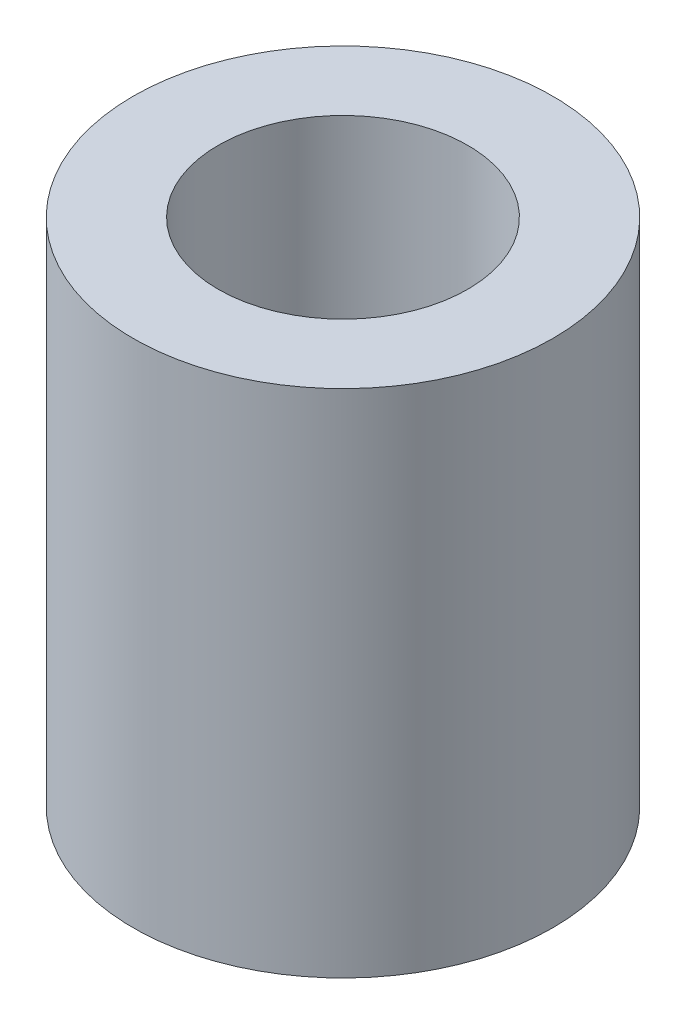
ISO-10303-21;
HEADER;
FILE_DESCRIPTION(('STEP AP214'),'2;1');
FILE_NAME('part.step','',(''),(''),'','','');
FILE_SCHEMA(('AUTOMOTIVE_DESIGN { 1 0 10303 214 1 1 1 1 }'));
ENDSEC;
DATA;
#1=APPLICATION_CONTEXT('core data for automotive mechanical design processes');
#2=APPLICATION_PROTOCOL_DEFINITION('international standard','automotive_design',2000,#1);
#3=PRODUCT_CONTEXT('',#1,'mechanical');
#4=PRODUCT('Part','Part','',(#3));
#5=PRODUCT_RELATED_PRODUCT_CATEGORY('part','',(#4));
#6=PRODUCT_DEFINITION_FORMATION('','',#4);
#7=PRODUCT_DEFINITION_CONTEXT('part definition',#1,'design');
#8=PRODUCT_DEFINITION('design','',#6,#7);
#9=PRODUCT_DEFINITION_SHAPE('','',#8);
#10=(LENGTH_UNIT() NAMED_UNIT(*) SI_UNIT(.MILLI.,.METRE.));
#11=(NAMED_UNIT(*) PLANE_ANGLE_UNIT() SI_UNIT($,.RADIAN.));
#12=(NAMED_UNIT(*) SI_UNIT($,.STERADIAN.) SOLID_ANGLE_UNIT());
#13=UNCERTAINTY_MEASURE_WITH_UNIT(LENGTH_MEASURE(1.E-05),#10,'distance_accuracy_value','');
#14=(GEOMETRIC_REPRESENTATION_CONTEXT(3) GLOBAL_UNCERTAINTY_ASSIGNED_CONTEXT((#13)) GLOBAL_UNIT_ASSIGNED_CONTEXT((#10,
#11,#12)) REPRESENTATION_CONTEXT('',''));
#15=CARTESIAN_POINT('',(0.,0.,0.));
#16=DIRECTION('',(0.,0.,1.));
#17=DIRECTION('',(1.,0.,0.));
#18=AXIS2_PLACEMENT_3D('',#15,#16,#17);
#19=CARTESIAN_POINT('',(0.,18.,0.));
#20=DIRECTION('',(0.,1.,0.));
#21=DIRECTION('',(0.,0.,1.));
#22=AXIS2_PLACEMENT_3D('',#19,#20,#21);
#23=PLANE('',#22);
#24=CARTESIAN_POINT('',(0.,18.,0.));
#25=DIRECTION('',(0.,1.,0.));
#26=DIRECTION('',(1.,0.,0.));
#27=AXIS2_PLACEMENT_3D('',#24,#25,#26);
#28=CIRCLE('',#27,7.4);
#29=CARTESIAN_POINT('',(7.4,18.,0.));
#30=VERTEX_POINT('',#29);
#31=EDGE_CURVE('E11',#30,#30,#28,.T.);
#32=ORIENTED_EDGE('',*,*,#31,.T.);
#33=EDGE_LOOP('',(#32));
#34=FACE_BOUND('',#33,.T.);
#35=CARTESIAN_POINT('',(0.,18.,0.));
#36=DIRECTION('',(0.,1.,0.));
#37=DIRECTION('',(0.,0.,1.));
#38=AXIS2_PLACEMENT_3D('',#35,#36,#37);
#39=CIRCLE('',#38,4.4);
#40=CARTESIAN_POINT('',(0.,18.,4.4));
#41=VERTEX_POINT('',#40);
#42=EDGE_CURVE('E58',#41,#41,#39,.T.);
#43=ORIENTED_EDGE('',*,*,#42,.F.);
#44=EDGE_LOOP('',(#43));
#45=FACE_BOUND('',#44,.T.);
#46=ADVANCED_FACE('F47',(#34,#45),#23,.T.);
#47=CARTESIAN_POINT('',(0.,0.,0.));
#48=DIRECTION('',(0.,1.,0.));
#49=DIRECTION('',(0.,0.,1.));
#50=AXIS2_PLACEMENT_3D('',#47,#48,#49);
#51=PLANE('',#50);
#52=CARTESIAN_POINT('',(0.,0.,0.));
#53=DIRECTION('',(0.,1.,0.));
#54=DIRECTION('',(1.,0.,0.));
#55=AXIS2_PLACEMENT_3D('',#52,#53,#54);
#56=CIRCLE('',#55,7.4);
#57=CARTESIAN_POINT('',(7.4,0.,0.));
#58=VERTEX_POINT('',#57);
#59=EDGE_CURVE('E51',#58,#58,#56,.T.);
#60=ORIENTED_EDGE('',*,*,#59,.F.);
#61=EDGE_LOOP('',(#60));
#62=FACE_BOUND('',#61,.T.);
#63=CARTESIAN_POINT('',(0.,0.,0.));
#64=DIRECTION('',(0.,1.,0.));
#65=DIRECTION('',(0.,0.,1.));
#66=AXIS2_PLACEMENT_3D('',#63,#64,#65);
#67=CIRCLE('',#66,4.4);
#68=CARTESIAN_POINT('',(0.,0.,4.4));
#69=VERTEX_POINT('',#68);
#70=EDGE_CURVE('E60',#69,#69,#67,.T.);
#71=ORIENTED_EDGE('',*,*,#70,.T.);
#72=EDGE_LOOP('',(#71));
#73=FACE_BOUND('',#72,.T.);
#74=ADVANCED_FACE('F70',(#62,#73),#51,.F.);
#75=CARTESIAN_POINT('',(0.,18.,0.));
#76=DIRECTION('',(0.,-1.,0.));
#77=DIRECTION('',(0.,0.,-1.));
#78=AXIS2_PLACEMENT_3D('',#75,#76,#77);
#79=CYLINDRICAL_SURFACE('',#78,7.4);
#80=ORIENTED_EDGE('',*,*,#31,.F.);
#81=EDGE_LOOP('',(#80));
#82=FACE_BOUND('',#81,.T.);
#83=ORIENTED_EDGE('',*,*,#59,.T.);
#84=EDGE_LOOP('',(#83));
#85=FACE_BOUND('',#84,.T.);
#86=ADVANCED_FACE('F49',(#82,#85),#79,.T.);
#87=CARTESIAN_POINT('',(0.,18.,0.));
#88=DIRECTION('',(0.,-1.,0.));
#89=DIRECTION('',(0.,0.,-1.));
#90=AXIS2_PLACEMENT_3D('',#87,#88,#89);
#91=CYLINDRICAL_SURFACE('',#90,4.4);
#92=ORIENTED_EDGE('',*,*,#42,.T.);
#93=EDGE_LOOP('',(#92));
#94=FACE_BOUND('',#93,.T.);
#95=ORIENTED_EDGE('',*,*,#70,.F.);
#96=EDGE_LOOP('',(#95));
#97=FACE_BOUND('',#96,.T.);
#98=ADVANCED_FACE('F66',(#94,#97),#91,.F.);
#99=CLOSED_SHELL('',(#46,#74,#86,#98));
#100=MANIFOLD_SOLID_BREP('B2',#99);
#101=ADVANCED_BREP_SHAPE_REPRESENTATION('',(#18,#100),#14);
#102=SHAPE_DEFINITION_REPRESENTATION(#9,#101);
ENDSEC;
END-ISO-10303-21;
